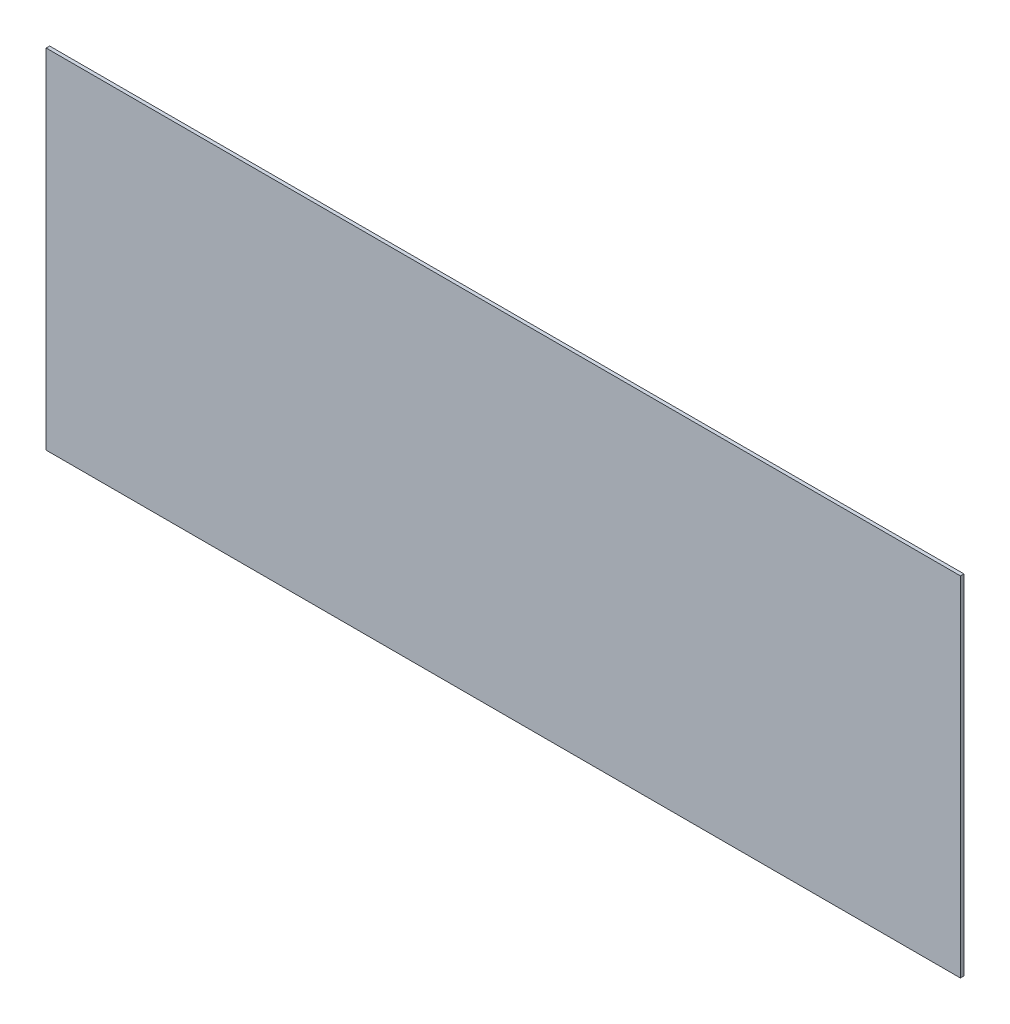
ISO-10303-21;
HEADER;
FILE_DESCRIPTION(('STEP AP214'),'2;1');
FILE_NAME('part.step','',(''),(''),'','','');
FILE_SCHEMA(('AUTOMOTIVE_DESIGN { 1 0 10303 214 1 1 1 1 }'));
ENDSEC;
DATA;
#1=APPLICATION_CONTEXT('core data for automotive mechanical design processes');
#2=APPLICATION_PROTOCOL_DEFINITION('international standard','automotive_design',2000,#1);
#3=PRODUCT_CONTEXT('',#1,'mechanical');
#4=PRODUCT('Part','Part','',(#3));
#5=PRODUCT_RELATED_PRODUCT_CATEGORY('part','',(#4));
#6=PRODUCT_DEFINITION_FORMATION('','',#4);
#7=PRODUCT_DEFINITION_CONTEXT('part definition',#1,'design');
#8=PRODUCT_DEFINITION('design','',#6,#7);
#9=PRODUCT_DEFINITION_SHAPE('','',#8);
#10=(LENGTH_UNIT() NAMED_UNIT(*) SI_UNIT(.MILLI.,.METRE.));
#11=(NAMED_UNIT(*) PLANE_ANGLE_UNIT() SI_UNIT($,.RADIAN.));
#12=(NAMED_UNIT(*) SI_UNIT($,.STERADIAN.) SOLID_ANGLE_UNIT());
#13=UNCERTAINTY_MEASURE_WITH_UNIT(LENGTH_MEASURE(1.E-05),#10,'distance_accuracy_value','');
#14=(GEOMETRIC_REPRESENTATION_CONTEXT(3) GLOBAL_UNCERTAINTY_ASSIGNED_CONTEXT((#13)) GLOBAL_UNIT_ASSIGNED_CONTEXT((#10,
#11,#12)) REPRESENTATION_CONTEXT('',''));
#15=CARTESIAN_POINT('',(0.,0.,0.));
#16=DIRECTION('',(0.,0.,1.));
#17=DIRECTION('',(1.,0.,0.));
#18=AXIS2_PLACEMENT_3D('',#15,#16,#17);
#19=CARTESIAN_POINT('',(33.3375,12.7,0.254));
#20=DIRECTION('',(-1.,0.,0.));
#21=DIRECTION('',(0.,-1.,0.));
#22=AXIS2_PLACEMENT_3D('',#19,#20,#21);
#23=PLANE('',#22);
#24=DIRECTION('',(0.,1.,0.));
#25=VECTOR('',#24,1.);
#26=CARTESIAN_POINT('',(33.3375,12.7,0.));
#27=LINE('',#26,#25);
#28=CARTESIAN_POINT('',(33.3375,-12.7,0.));
#29=VERTEX_POINT('',#28);
#30=CARTESIAN_POINT('',(33.3375,12.7,0.));
#31=VERTEX_POINT('',#30);
#32=EDGE_CURVE('E100',#29,#31,#27,.T.);
#33=ORIENTED_EDGE('',*,*,#32,.T.);
#34=DIRECTION('',(0.,0.,-1.));
#35=VECTOR('',#34,1.);
#36=CARTESIAN_POINT('',(33.3375,12.7,0.254));
#37=LINE('',#36,#35);
#38=CARTESIAN_POINT('',(33.3375,12.7,0.254));
#39=VERTEX_POINT('',#38);
#40=EDGE_CURVE('E11',#39,#31,#37,.T.);
#41=ORIENTED_EDGE('',*,*,#40,.F.);
#42=DIRECTION('',(0.,1.,0.));
#43=VECTOR('',#42,1.);
#44=CARTESIAN_POINT('',(33.3375,12.7,0.254));
#45=LINE('',#44,#43);
#46=CARTESIAN_POINT('',(33.3375,-12.7,0.254));
#47=VERTEX_POINT('',#46);
#48=EDGE_CURVE('E88',#47,#39,#45,.T.);
#49=ORIENTED_EDGE('',*,*,#48,.F.);
#50=DIRECTION('',(0.,0.,-1.));
#51=VECTOR('',#50,1.);
#52=CARTESIAN_POINT('',(33.3375,-12.7,0.254));
#53=LINE('',#52,#51);
#54=EDGE_CURVE('E96',#47,#29,#53,.T.);
#55=ORIENTED_EDGE('',*,*,#54,.T.);
#56=EDGE_LOOP('',(#33,#41,#49,#55));
#57=FACE_BOUND('',#56,.T.);
#58=ADVANCED_FACE('F37',(#57),#23,.F.);
#59=CARTESIAN_POINT('',(-33.3375,12.7,0.254));
#60=DIRECTION('',(0.,-1.,0.));
#61=DIRECTION('',(0.,0.,-1.));
#62=AXIS2_PLACEMENT_3D('',#59,#60,#61);
#63=PLANE('',#62);
#64=DIRECTION('',(-1.,0.,0.));
#65=VECTOR('',#64,1.);
#66=CARTESIAN_POINT('',(-33.3375,12.7,0.));
#67=LINE('',#66,#65);
#68=CARTESIAN_POINT('',(-33.3375,12.7,0.));
#69=VERTEX_POINT('',#68);
#70=EDGE_CURVE('E92',#31,#69,#67,.T.);
#71=ORIENTED_EDGE('',*,*,#70,.T.);
#72=DIRECTION('',(0.,0.,-1.));
#73=VECTOR('',#72,1.);
#74=CARTESIAN_POINT('',(-33.3375,12.7,0.254));
#75=LINE('',#74,#73);
#76=CARTESIAN_POINT('',(-33.3375,12.7,0.254));
#77=VERTEX_POINT('',#76);
#78=EDGE_CURVE('E45',#77,#69,#75,.T.);
#79=ORIENTED_EDGE('',*,*,#78,.F.);
#80=DIRECTION('',(-1.,0.,0.));
#81=VECTOR('',#80,1.);
#82=CARTESIAN_POINT('',(-33.3375,12.7,0.254));
#83=LINE('',#82,#81);
#84=EDGE_CURVE('E83',#39,#77,#83,.T.);
#85=ORIENTED_EDGE('',*,*,#84,.F.);
#86=ORIENTED_EDGE('',*,*,#40,.T.);
#87=EDGE_LOOP('',(#71,#79,#85,#86));
#88=FACE_BOUND('',#87,.T.);
#89=ADVANCED_FACE('F91',(#88),#63,.F.);
#90=CARTESIAN_POINT('',(-33.3375,12.7,0.254));
#91=DIRECTION('',(1.,0.,0.));
#92=DIRECTION('',(0.,1.,0.));
#93=AXIS2_PLACEMENT_3D('',#90,#91,#92);
#94=PLANE('',#93);
#95=DIRECTION('',(0.,-1.,0.));
#96=VECTOR('',#95,1.);
#97=CARTESIAN_POINT('',(-33.3375,12.7,0.));
#98=LINE('',#97,#96);
#99=CARTESIAN_POINT('',(-33.3375,-12.7,0.));
#100=VERTEX_POINT('',#99);
#101=EDGE_CURVE('E70',#69,#100,#98,.T.);
#102=ORIENTED_EDGE('',*,*,#101,.T.);
#103=DIRECTION('',(0.,0.,-1.));
#104=VECTOR('',#103,1.);
#105=CARTESIAN_POINT('',(-33.3375,-12.7,0.254));
#106=LINE('',#105,#104);
#107=CARTESIAN_POINT('',(-33.3375,-12.7,0.254));
#108=VERTEX_POINT('',#107);
#109=EDGE_CURVE('E93',#108,#100,#106,.T.);
#110=ORIENTED_EDGE('',*,*,#109,.F.);
#111=DIRECTION('',(0.,-1.,0.));
#112=VECTOR('',#111,1.);
#113=CARTESIAN_POINT('',(-33.3375,12.7,0.254));
#114=LINE('',#113,#112);
#115=EDGE_CURVE('E86',#77,#108,#114,.T.);
#116=ORIENTED_EDGE('',*,*,#115,.F.);
#117=ORIENTED_EDGE('',*,*,#78,.T.);
#118=EDGE_LOOP('',(#102,#110,#116,#117));
#119=FACE_BOUND('',#118,.T.);
#120=ADVANCED_FACE('F94',(#119),#94,.F.);
#121=CARTESIAN_POINT('',(-33.3375,-12.7,0.254));
#122=DIRECTION('',(0.,1.,0.));
#123=DIRECTION('',(0.,0.,1.));
#124=AXIS2_PLACEMENT_3D('',#121,#122,#123);
#125=PLANE('',#124);
#126=DIRECTION('',(1.,0.,0.));
#127=VECTOR('',#126,1.);
#128=CARTESIAN_POINT('',(-33.3375,-12.7,0.));
#129=LINE('',#128,#127);
#130=EDGE_CURVE('E76',#100,#29,#129,.T.);
#131=ORIENTED_EDGE('',*,*,#130,.T.);
#132=ORIENTED_EDGE('',*,*,#54,.F.);
#133=DIRECTION('',(1.,0.,0.));
#134=VECTOR('',#133,1.);
#135=CARTESIAN_POINT('',(-33.3375,-12.7,0.254));
#136=LINE('',#135,#134);
#137=EDGE_CURVE('E53',#108,#47,#136,.T.);
#138=ORIENTED_EDGE('',*,*,#137,.F.);
#139=ORIENTED_EDGE('',*,*,#109,.T.);
#140=EDGE_LOOP('',(#131,#132,#138,#139));
#141=FACE_BOUND('',#140,.T.);
#142=ADVANCED_FACE('F107',(#141),#125,.F.);
#143=CARTESIAN_POINT('',(0.,0.,0.254));
#144=DIRECTION('',(0.,0.,1.));
#145=DIRECTION('',(1.,0.,0.));
#146=AXIS2_PLACEMENT_3D('',#143,#144,#145);
#147=PLANE('',#146);
#148=ORIENTED_EDGE('',*,*,#48,.T.);
#149=ORIENTED_EDGE('',*,*,#84,.T.);
#150=ORIENTED_EDGE('',*,*,#115,.T.);
#151=ORIENTED_EDGE('',*,*,#137,.T.);
#152=EDGE_LOOP('',(#148,#149,#150,#151));
#153=FACE_BOUND('',#152,.T.);
#154=ADVANCED_FACE('F84',(#153),#147,.T.);
#155=CARTESIAN_POINT('',(0.,0.,0.));
#156=DIRECTION('',(0.,0.,1.));
#157=DIRECTION('',(1.,0.,0.));
#158=AXIS2_PLACEMENT_3D('',#155,#156,#157);
#159=PLANE('',#158);
#160=ORIENTED_EDGE('',*,*,#32,.F.);
#161=ORIENTED_EDGE('',*,*,#130,.F.);
#162=ORIENTED_EDGE('',*,*,#101,.F.);
#163=ORIENTED_EDGE('',*,*,#70,.F.);
#164=EDGE_LOOP('',(#160,#161,#162,#163));
#165=FACE_BOUND('',#164,.T.);
#166=ADVANCED_FACE('F110',(#165),#159,.F.);
#167=CLOSED_SHELL('',(#58,#89,#120,#142,#154,#166));
#168=MANIFOLD_SOLID_BREP('B2',#167);
#169=ADVANCED_BREP_SHAPE_REPRESENTATION('',(#18,#168),#14);
#170=SHAPE_DEFINITION_REPRESENTATION(#9,#169);
ENDSEC;
END-ISO-10303-21;
